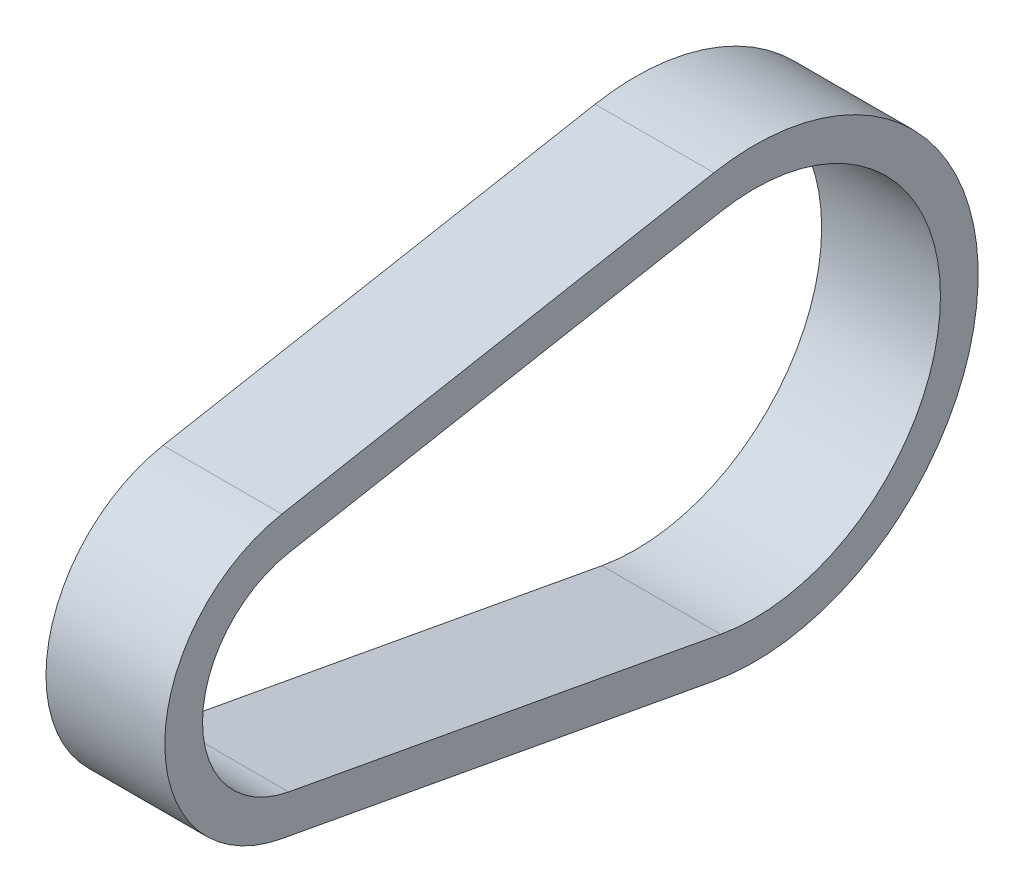
ISO-10303-21;
HEADER;
FILE_DESCRIPTION(('STEP AP214'),'2;1');
FILE_NAME('part.step','',(''),(''),'','','');
FILE_SCHEMA(('AUTOMOTIVE_DESIGN { 1 0 10303 214 1 1 1 1 }'));
ENDSEC;
DATA;
#1=APPLICATION_CONTEXT('core data for automotive mechanical design processes');
#2=APPLICATION_PROTOCOL_DEFINITION('international standard','automotive_design',2000,#1);
#3=PRODUCT_CONTEXT('',#1,'mechanical');
#4=PRODUCT('Part','Part','',(#3));
#5=PRODUCT_RELATED_PRODUCT_CATEGORY('part','',(#4));
#6=PRODUCT_DEFINITION_FORMATION('','',#4);
#7=PRODUCT_DEFINITION_CONTEXT('part definition',#1,'design');
#8=PRODUCT_DEFINITION('design','',#6,#7);
#9=PRODUCT_DEFINITION_SHAPE('','',#8);
#10=(LENGTH_UNIT() NAMED_UNIT(*) SI_UNIT(.MILLI.,.METRE.));
#11=(NAMED_UNIT(*) PLANE_ANGLE_UNIT() SI_UNIT($,.RADIAN.));
#12=(NAMED_UNIT(*) SI_UNIT($,.STERADIAN.) SOLID_ANGLE_UNIT());
#13=UNCERTAINTY_MEASURE_WITH_UNIT(LENGTH_MEASURE(1.E-05),#10,'distance_accuracy_value','');
#14=(GEOMETRIC_REPRESENTATION_CONTEXT(3) GLOBAL_UNCERTAINTY_ASSIGNED_CONTEXT((#13)) GLOBAL_UNIT_ASSIGNED_CONTEXT((#10,
#11,#12)) REPRESENTATION_CONTEXT('',''));
#15=CARTESIAN_POINT('',(0.,0.,0.));
#16=DIRECTION('',(0.,0.,1.));
#17=DIRECTION('',(1.,0.,0.));
#18=AXIS2_PLACEMENT_3D('',#15,#16,#17);
#19=CARTESIAN_POINT('',(7.5,0.,0.));
#20=DIRECTION('',(1.,0.,0.));
#21=DIRECTION('',(0.,0.,-1.));
#22=AXIS2_PLACEMENT_3D('',#19,#20,#21);
#23=PLANE('',#22);
#24=CARTESIAN_POINT('',(7.5,0.,0.));
#25=DIRECTION('',(1.,0.,0.));
#26=DIRECTION('',(0.,0.,-1.));
#27=AXIS2_PLACEMENT_3D('',#24,#25,#26);
#28=CIRCLE('',#27,18.0467);
#29=CARTESIAN_POINT('',(7.5,17.7485859420222,3.26666159077603));
#30=VERTEX_POINT('',#29);
#31=CARTESIAN_POINT('',(7.5,-17.7485859420222,3.26666159077603));
#32=VERTEX_POINT('',#31);
#33=EDGE_CURVE('E139',#30,#32,#28,.T.);
#34=ORIENTED_EDGE('',*,*,#33,.T.);
#35=DIRECTION('',(0.,-0.181011575012386,-0.983480965607131));
#36=VECTOR('',#35,1.);
#37=CARTESIAN_POINT('',(7.5,-17.7485859420222,3.26666159077603));
#38=LINE('',#37,#36);
#39=CARTESIAN_POINT('',(7.5,-27.7882153439909,-51.281145188488));
#40=VERTEX_POINT('',#39);
#41=EDGE_CURVE('E142',#32,#40,#38,.T.);
#42=ORIENTED_EDGE('',*,*,#41,.T.);
#43=CARTESIAN_POINT('',(7.5,0.,-56.39562));
#44=DIRECTION('',(1.,0.,0.));
#45=DIRECTION('',(0.,0.,-1.));
#46=AXIS2_PLACEMENT_3D('',#43,#44,#45);
#47=CIRCLE('',#46,28.25496);
#48=CARTESIAN_POINT('',(7.5,27.7882153439909,-51.281145188488));
#49=VERTEX_POINT('',#48);
#50=EDGE_CURVE('E145',#40,#49,#47,.T.);
#51=ORIENTED_EDGE('',*,*,#50,.T.);
#52=DIRECTION('',(0.,-0.181011575012386,0.983480965607131));
#53=VECTOR('',#52,1.);
#54=CARTESIAN_POINT('',(7.5,17.7485859420222,3.26666159077603));
#55=LINE('',#54,#53);
#56=EDGE_CURVE('E147',#49,#30,#55,.T.);
#57=ORIENTED_EDGE('',*,*,#56,.T.);
#58=EDGE_LOOP('',(#34,#42,#51,#57));
#59=FACE_BOUND('',#58,.T.);
#60=DIRECTION('',(0.,-0.181011575012386,-0.983480965607131));
#61=VECTOR('',#60,1.);
#62=CARTESIAN_POINT('',(7.5,-13.0647578433183,2.40459396477954));
#63=LINE('',#62,#61);
#64=CARTESIAN_POINT('',(7.5,-13.0647578433183,2.40459396477954));
#65=VERTEX_POINT('',#64);
#66=CARTESIAN_POINT('',(7.5,-23.1043872452869,-52.1432128144845));
#67=VERTEX_POINT('',#66);
#68=EDGE_CURVE('E111',#65,#67,#63,.T.);
#69=ORIENTED_EDGE('',*,*,#68,.F.);
#70=CARTESIAN_POINT('',(7.5,0.,0.));
#71=DIRECTION('',(1.,0.,0.));
#72=DIRECTION('',(0.,0.,-1.));
#73=AXIS2_PLACEMENT_3D('',#70,#71,#72);
#74=CIRCLE('',#73,13.2842);
#75=CARTESIAN_POINT('',(7.5,13.0647578433183,2.40459396477954));
#76=VERTEX_POINT('',#75);
#77=EDGE_CURVE('E103',#76,#65,#74,.T.);
#78=ORIENTED_EDGE('',*,*,#77,.F.);
#79=DIRECTION('',(0.,-0.181011575012386,0.983480965607131));
#80=VECTOR('',#79,1.);
#81=CARTESIAN_POINT('',(7.5,13.0647578433183,2.40459396477954));
#82=LINE('',#81,#80);
#83=CARTESIAN_POINT('',(7.5,23.1043872452869,-52.1432128144845));
#84=VERTEX_POINT('',#83);
#85=EDGE_CURVE('E125',#84,#76,#82,.T.);
#86=ORIENTED_EDGE('',*,*,#85,.F.);
#87=CARTESIAN_POINT('',(7.5,0.,-56.39562));
#88=DIRECTION('',(1.,0.,0.));
#89=DIRECTION('',(0.,0.,-1.));
#90=AXIS2_PLACEMENT_3D('',#87,#88,#89);
#91=CIRCLE('',#90,23.49246);
#92=EDGE_CURVE('E123',#67,#84,#91,.T.);
#93=ORIENTED_EDGE('',*,*,#92,.F.);
#94=EDGE_LOOP('',(#69,#78,#86,#93));
#95=FACE_BOUND('',#94,.T.);
#96=ADVANCED_FACE('F38',(#59,#95),#23,.T.);
#97=CARTESIAN_POINT('',(-7.5,0.,0.));
#98=DIRECTION('',(1.,0.,0.));
#99=DIRECTION('',(0.,0.,-1.));
#100=AXIS2_PLACEMENT_3D('',#97,#98,#99);
#101=PLANE('',#100);
#102=CARTESIAN_POINT('',(-7.5,0.,0.));
#103=DIRECTION('',(1.,0.,0.));
#104=DIRECTION('',(0.,0.,-1.));
#105=AXIS2_PLACEMENT_3D('',#102,#103,#104);
#106=CIRCLE('',#105,18.0467);
#107=CARTESIAN_POINT('',(-7.5,17.7485859420222,3.26666159077603));
#108=VERTEX_POINT('',#107);
#109=CARTESIAN_POINT('',(-7.5,-17.7485859420222,3.26666159077603));
#110=VERTEX_POINT('',#109);
#111=EDGE_CURVE('E119',#108,#110,#106,.T.);
#112=ORIENTED_EDGE('',*,*,#111,.F.);
#113=DIRECTION('',(0.,-0.181011575012386,0.983480965607131));
#114=VECTOR('',#113,1.);
#115=CARTESIAN_POINT('',(-7.5,17.7485859420222,3.26666159077603));
#116=LINE('',#115,#114);
#117=CARTESIAN_POINT('',(-7.5,27.7882153439909,-51.281145188488));
#118=VERTEX_POINT('',#117);
#119=EDGE_CURVE('E143',#118,#108,#116,.T.);
#120=ORIENTED_EDGE('',*,*,#119,.F.);
#121=CARTESIAN_POINT('',(-7.5,0.,-56.39562));
#122=DIRECTION('',(1.,0.,0.));
#123=DIRECTION('',(0.,0.,-1.));
#124=AXIS2_PLACEMENT_3D('',#121,#122,#123);
#125=CIRCLE('',#124,28.25496);
#126=CARTESIAN_POINT('',(-7.5,-27.7882153439909,-51.281145188488));
#127=VERTEX_POINT('',#126);
#128=EDGE_CURVE('E154',#127,#118,#125,.T.);
#129=ORIENTED_EDGE('',*,*,#128,.F.);
#130=DIRECTION('',(0.,-0.181011575012386,-0.983480965607131));
#131=VECTOR('',#130,1.);
#132=CARTESIAN_POINT('',(-7.5,-17.7485859420222,3.26666159077603));
#133=LINE('',#132,#131);
#134=EDGE_CURVE('E152',#110,#127,#133,.T.);
#135=ORIENTED_EDGE('',*,*,#134,.F.);
#136=EDGE_LOOP('',(#112,#120,#129,#135));
#137=FACE_BOUND('',#136,.T.);
#138=CARTESIAN_POINT('',(-7.5,0.,0.));
#139=DIRECTION('',(1.,0.,0.));
#140=DIRECTION('',(0.,0.,-1.));
#141=AXIS2_PLACEMENT_3D('',#138,#139,#140);
#142=CIRCLE('',#141,13.2842);
#143=CARTESIAN_POINT('',(-7.5,13.0647578433183,2.40459396477954));
#144=VERTEX_POINT('',#143);
#145=CARTESIAN_POINT('',(-7.5,-13.0647578433183,2.40459396477954));
#146=VERTEX_POINT('',#145);
#147=EDGE_CURVE('E61',#144,#146,#142,.T.);
#148=ORIENTED_EDGE('',*,*,#147,.T.);
#149=DIRECTION('',(0.,-0.181011575012386,-0.983480965607131));
#150=VECTOR('',#149,1.);
#151=CARTESIAN_POINT('',(-7.5,-13.0647578433183,2.40459396477954));
#152=LINE('',#151,#150);
#153=CARTESIAN_POINT('',(-7.5,-23.1043872452869,-52.1432128144845));
#154=VERTEX_POINT('',#153);
#155=EDGE_CURVE('E118',#146,#154,#152,.T.);
#156=ORIENTED_EDGE('',*,*,#155,.T.);
#157=CARTESIAN_POINT('',(-7.5,0.,-56.39562));
#158=DIRECTION('',(1.,0.,0.));
#159=DIRECTION('',(0.,0.,-1.));
#160=AXIS2_PLACEMENT_3D('',#157,#158,#159);
#161=CIRCLE('',#160,23.49246);
#162=CARTESIAN_POINT('',(-7.5,23.1043872452869,-52.1432128144845));
#163=VERTEX_POINT('',#162);
#164=EDGE_CURVE('E131',#154,#163,#161,.T.);
#165=ORIENTED_EDGE('',*,*,#164,.T.);
#166=DIRECTION('',(0.,-0.181011575012386,0.983480965607131));
#167=VECTOR('',#166,1.);
#168=CARTESIAN_POINT('',(-7.5,13.0647578433183,2.40459396477954));
#169=LINE('',#168,#167);
#170=EDGE_CURVE('E112',#163,#144,#169,.T.);
#171=ORIENTED_EDGE('',*,*,#170,.T.);
#172=EDGE_LOOP('',(#148,#156,#165,#171));
#173=FACE_BOUND('',#172,.T.);
#174=ADVANCED_FACE('F172',(#137,#173),#101,.F.);
#175=CARTESIAN_POINT('',(7.5,0.,0.));
#176=DIRECTION('',(-1.,0.,0.));
#177=DIRECTION('',(0.,0.,1.));
#178=AXIS2_PLACEMENT_3D('',#175,#176,#177);
#179=CYLINDRICAL_SURFACE('',#178,18.0467);
#180=ORIENTED_EDGE('',*,*,#111,.T.);
#181=DIRECTION('',(-1.,0.,0.));
#182=VECTOR('',#181,1.);
#183=CARTESIAN_POINT('',(7.5,-17.7485859420222,3.26666159077603));
#184=LINE('',#183,#182);
#185=EDGE_CURVE('E11',#32,#110,#184,.T.);
#186=ORIENTED_EDGE('',*,*,#185,.F.);
#187=ORIENTED_EDGE('',*,*,#33,.F.);
#188=DIRECTION('',(-1.,0.,0.));
#189=VECTOR('',#188,1.);
#190=CARTESIAN_POINT('',(7.5,17.7485859420222,3.26666159077603));
#191=LINE('',#190,#189);
#192=EDGE_CURVE('E149',#30,#108,#191,.T.);
#193=ORIENTED_EDGE('',*,*,#192,.T.);
#194=EDGE_LOOP('',(#180,#186,#187,#193));
#195=FACE_BOUND('',#194,.T.);
#196=ADVANCED_FACE('F40',(#195),#179,.T.);
#197=CARTESIAN_POINT('',(7.5,-17.7485859420222,3.26666159077603));
#198=DIRECTION('',(0.,0.983480965607131,-0.181011575012386));
#199=DIRECTION('',(0.,0.181011575012386,0.983480965607131));
#200=AXIS2_PLACEMENT_3D('',#197,#198,#199);
#201=PLANE('',#200);
#202=ORIENTED_EDGE('',*,*,#134,.T.);
#203=DIRECTION('',(-1.,0.,0.));
#204=VECTOR('',#203,1.);
#205=CARTESIAN_POINT('',(7.5,-27.7882153439909,-51.281145188488));
#206=LINE('',#205,#204);
#207=EDGE_CURVE('E46',#40,#127,#206,.T.);
#208=ORIENTED_EDGE('',*,*,#207,.F.);
#209=ORIENTED_EDGE('',*,*,#41,.F.);
#210=ORIENTED_EDGE('',*,*,#185,.T.);
#211=EDGE_LOOP('',(#202,#208,#209,#210));
#212=FACE_BOUND('',#211,.T.);
#213=ADVANCED_FACE('F182',(#212),#201,.F.);
#214=CARTESIAN_POINT('',(7.5,0.,-56.39562));
#215=DIRECTION('',(-1.,0.,0.));
#216=DIRECTION('',(0.,0.,1.));
#217=AXIS2_PLACEMENT_3D('',#214,#215,#216);
#218=CYLINDRICAL_SURFACE('',#217,28.25496);
#219=ORIENTED_EDGE('',*,*,#128,.T.);
#220=DIRECTION('',(-1.,0.,0.));
#221=VECTOR('',#220,1.);
#222=CARTESIAN_POINT('',(7.5,27.7882153439909,-51.281145188488));
#223=LINE('',#222,#221);
#224=EDGE_CURVE('E159',#49,#118,#223,.T.);
#225=ORIENTED_EDGE('',*,*,#224,.F.);
#226=ORIENTED_EDGE('',*,*,#50,.F.);
#227=ORIENTED_EDGE('',*,*,#207,.T.);
#228=EDGE_LOOP('',(#219,#225,#226,#227));
#229=FACE_BOUND('',#228,.T.);
#230=ADVANCED_FACE('F166',(#229),#218,.T.);
#231=CARTESIAN_POINT('',(7.5,17.7485859420222,3.26666159077603));
#232=DIRECTION('',(0.,-0.983480965607131,-0.181011575012386));
#233=DIRECTION('',(0.,0.181011575012386,-0.983480965607131));
#234=AXIS2_PLACEMENT_3D('',#231,#232,#233);
#235=PLANE('',#234);
#236=ORIENTED_EDGE('',*,*,#119,.T.);
#237=ORIENTED_EDGE('',*,*,#192,.F.);
#238=ORIENTED_EDGE('',*,*,#56,.F.);
#239=ORIENTED_EDGE('',*,*,#224,.T.);
#240=EDGE_LOOP('',(#236,#237,#238,#239));
#241=FACE_BOUND('',#240,.T.);
#242=ADVANCED_FACE('F176',(#241),#235,.F.);
#243=CARTESIAN_POINT('',(7.5,0.,0.));
#244=DIRECTION('',(-1.,0.,0.));
#245=DIRECTION('',(0.,0.,1.));
#246=AXIS2_PLACEMENT_3D('',#243,#244,#245);
#247=CYLINDRICAL_SURFACE('',#246,13.2842);
#248=ORIENTED_EDGE('',*,*,#147,.F.);
#249=DIRECTION('',(-1.,0.,0.));
#250=VECTOR('',#249,1.);
#251=CARTESIAN_POINT('',(7.5,13.0647578433183,2.40459396477954));
#252=LINE('',#251,#250);
#253=EDGE_CURVE('E107',#76,#144,#252,.T.);
#254=ORIENTED_EDGE('',*,*,#253,.F.);
#255=ORIENTED_EDGE('',*,*,#77,.T.);
#256=DIRECTION('',(-1.,0.,0.));
#257=VECTOR('',#256,1.);
#258=CARTESIAN_POINT('',(7.5,-13.0647578433183,2.40459396477954));
#259=LINE('',#258,#257);
#260=EDGE_CURVE('E106',#65,#146,#259,.T.);
#261=ORIENTED_EDGE('',*,*,#260,.T.);
#262=EDGE_LOOP('',(#248,#254,#255,#261));
#263=FACE_BOUND('',#262,.T.);
#264=ADVANCED_FACE('F105',(#263),#247,.F.);
#265=CARTESIAN_POINT('',(7.5,-13.0647578433183,2.40459396477954));
#266=DIRECTION('',(0.,0.983480965607131,-0.181011575012386));
#267=DIRECTION('',(0.,0.181011575012386,0.983480965607131));
#268=AXIS2_PLACEMENT_3D('',#265,#266,#267);
#269=PLANE('',#268);
#270=ORIENTED_EDGE('',*,*,#155,.F.);
#271=ORIENTED_EDGE('',*,*,#260,.F.);
#272=ORIENTED_EDGE('',*,*,#68,.T.);
#273=DIRECTION('',(-1.,0.,0.));
#274=VECTOR('',#273,1.);
#275=CARTESIAN_POINT('',(7.5,-23.1043872452869,-52.1432128144845));
#276=LINE('',#275,#274);
#277=EDGE_CURVE('E120',#67,#154,#276,.T.);
#278=ORIENTED_EDGE('',*,*,#277,.T.);
#279=EDGE_LOOP('',(#270,#271,#272,#278));
#280=FACE_BOUND('',#279,.T.);
#281=ADVANCED_FACE('F115',(#280),#269,.T.);
#282=CARTESIAN_POINT('',(7.5,0.,-56.39562));
#283=DIRECTION('',(-1.,0.,0.));
#284=DIRECTION('',(0.,0.,1.));
#285=AXIS2_PLACEMENT_3D('',#282,#283,#284);
#286=CYLINDRICAL_SURFACE('',#285,23.49246);
#287=ORIENTED_EDGE('',*,*,#164,.F.);
#288=ORIENTED_EDGE('',*,*,#277,.F.);
#289=ORIENTED_EDGE('',*,*,#92,.T.);
#290=DIRECTION('',(-1.,0.,0.));
#291=VECTOR('',#290,1.);
#292=CARTESIAN_POINT('',(7.5,23.1043872452869,-52.1432128144845));
#293=LINE('',#292,#291);
#294=EDGE_CURVE('E53',#84,#163,#293,.T.);
#295=ORIENTED_EDGE('',*,*,#294,.T.);
#296=EDGE_LOOP('',(#287,#288,#289,#295));
#297=FACE_BOUND('',#296,.T.);
#298=ADVANCED_FACE('F205',(#297),#286,.F.);
#299=CARTESIAN_POINT('',(7.5,13.0647578433183,2.40459396477954));
#300=DIRECTION('',(0.,-0.983480965607131,-0.181011575012386));
#301=DIRECTION('',(0.,0.181011575012386,-0.983480965607131));
#302=AXIS2_PLACEMENT_3D('',#299,#300,#301);
#303=PLANE('',#302);
#304=ORIENTED_EDGE('',*,*,#170,.F.);
#305=ORIENTED_EDGE('',*,*,#294,.F.);
#306=ORIENTED_EDGE('',*,*,#85,.T.);
#307=ORIENTED_EDGE('',*,*,#253,.T.);
#308=EDGE_LOOP('',(#304,#305,#306,#307));
#309=FACE_BOUND('',#308,.T.);
#310=ADVANCED_FACE('F209',(#309),#303,.T.);
#311=CLOSED_SHELL('',(#96,#174,#196,#213,#230,#242,#264,#281,#298,#310));
#312=MANIFOLD_SOLID_BREP('B2',#311);
#313=ADVANCED_BREP_SHAPE_REPRESENTATION('',(#18,#312),#14);
#314=SHAPE_DEFINITION_REPRESENTATION(#9,#313);
ENDSEC;
END-ISO-10303-21;
